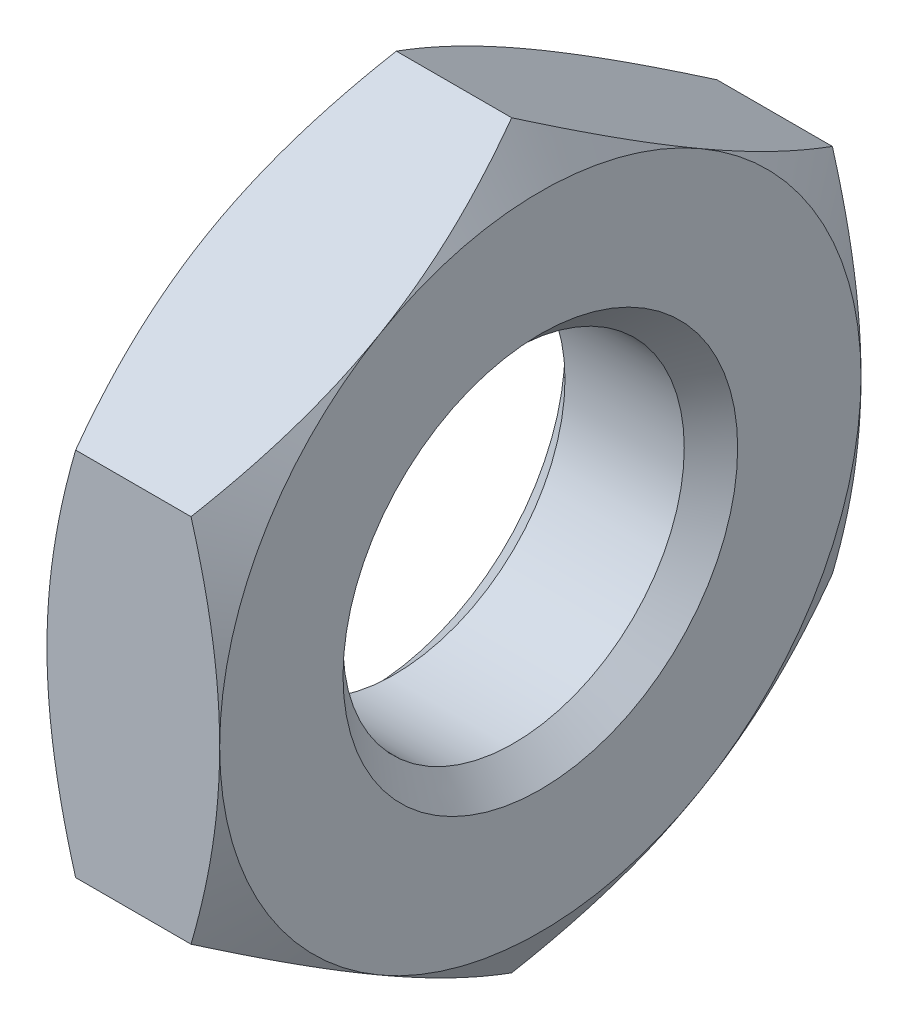
ISO-10303-21;
HEADER;
FILE_DESCRIPTION(('STEP AP214'),'2;1');
FILE_NAME('part.step','',(''),(''),'','','');
FILE_SCHEMA(('AUTOMOTIVE_DESIGN { 1 0 10303 214 1 1 1 1 }'));
ENDSEC;
DATA;
#1=APPLICATION_CONTEXT('core data for automotive mechanical design processes');
#2=APPLICATION_PROTOCOL_DEFINITION('international standard','automotive_design',2000,#1);
#3=PRODUCT_CONTEXT('',#1,'mechanical');
#4=PRODUCT('Part','Part','',(#3));
#5=PRODUCT_RELATED_PRODUCT_CATEGORY('part','',(#4));
#6=PRODUCT_DEFINITION_FORMATION('','',#4);
#7=PRODUCT_DEFINITION_CONTEXT('part definition',#1,'design');
#8=PRODUCT_DEFINITION('design','',#6,#7);
#9=PRODUCT_DEFINITION_SHAPE('','',#8);
#10=(LENGTH_UNIT() NAMED_UNIT(*) SI_UNIT(.MILLI.,.METRE.));
#11=(NAMED_UNIT(*) PLANE_ANGLE_UNIT() SI_UNIT($,.RADIAN.));
#12=(NAMED_UNIT(*) SI_UNIT($,.STERADIAN.) SOLID_ANGLE_UNIT());
#13=UNCERTAINTY_MEASURE_WITH_UNIT(LENGTH_MEASURE(1.E-05),#10,'distance_accuracy_value','');
#14=(GEOMETRIC_REPRESENTATION_CONTEXT(3) GLOBAL_UNCERTAINTY_ASSIGNED_CONTEXT((#13)) GLOBAL_UNIT_ASSIGNED_CONTEXT((#10,
#11,#12)) REPRESENTATION_CONTEXT('',''));
#15=CARTESIAN_POINT('',(0.,0.,0.));
#16=DIRECTION('',(0.,0.,1.));
#17=DIRECTION('',(1.,0.,0.));
#18=AXIS2_PLACEMENT_3D('',#15,#16,#17);
#19=CARTESIAN_POINT('',(27.5,0.,0.));
#20=DIRECTION('',(1.,0.,0.));
#21=DIRECTION('',(0.,0.,1.));
#22=AXIS2_PLACEMENT_3D('',#19,#20,#21);
#23=CONICAL_SURFACE('',#22,6.5,1.0471975511966);
#24=CARTESIAN_POINT('',(28.0805572502676,7.50555465416567,1.99999999888977E-06));
#25=CARTESIAN_POINT('',(28.0329411522362,7.42306527723567,-0.142873791927453));
#26=CARTESIAN_POINT('',(27.9874862264941,7.34026834106243,-0.286282292090547));
#27=CARTESIAN_POINT('',(27.9014939227888,7.17400208014972,-0.574263903575862));
#28=CARTESIAN_POINT('',(27.8609586661771,7.09053248178623,-0.718837488828798));
#29=CARTESIAN_POINT('',(27.7475281183766,6.83878732720467,-1.15487288712335));
#30=CARTESIAN_POINT('',(27.6830111190427,6.66951807893899,-1.44805582527849));
#31=CARTESIAN_POINT('',(27.6073591259132,6.41620974890769,-1.88679872287313));
#32=CARTESIAN_POINT('',(27.5858084178639,6.33292745266914,-2.0310478913293));
#33=CARTESIAN_POINT('',(27.5496718853767,6.16598660334749,-2.32019792421309));
#34=CARTESIAN_POINT('',(27.5350854455776,6.08232808416699,-2.46509872991969));
#35=CARTESIAN_POINT('',(27.5132491881389,5.91486579606871,-2.75515192125765));
#36=CARTESIAN_POINT('',(27.5059910453223,5.83106230055643,-2.90030383333679));
#37=CARTESIAN_POINT('',(27.4989592217746,5.66338258203352,-3.19073362521733));
#38=CARTESIAN_POINT('',(27.4991853097409,5.5795063613506,-3.33601150098701));
#39=CARTESIAN_POINT('',(27.5100914728005,5.34972711742178,-3.73400082599649));
#40=CARTESIAN_POINT('',(27.5283909317871,5.20389935455449,-3.98658192043674));
#41=CARTESIAN_POINT('',(27.5864124807486,4.91321237846649,-4.49006653211969));
#42=CARTESIAN_POINT('',(27.6261543917517,4.7683541871297,-4.74096827940755));
#43=CARTESIAN_POINT('',(27.7254952028274,4.47708246697613,-5.24546569752153));
#44=CARTESIAN_POINT('',(27.785514893733,4.33070568094781,-5.49899772797121));
#45=CARTESIAN_POINT('',(27.9217344418106,4.04013468328328,-6.00228145913216));
#46=CARTESIAN_POINT('',(27.9979023128666,3.89593675196615,-6.25203960251976));
#47=CARTESIAN_POINT('',(28.0805572502676,3.75277559503203,-6.500002));
#48=B_SPLINE_CURVE_WITH_KNOTS('',3,(#24,#25,#26,#27,#28,#29,#30,#31,#32,#33,#34,#35,#36,#37,#38,
#39,#40,#41,#42,#43,#44,#45,#46,#47),.UNSPECIFIED.,.F.,.F.,(4,2,2,2,2,2,2,2,2,2,2,4),(0.,
0.5150972308121,1.03041578730196,2.0631938175307,2.56693508465116,3.07063183306576,
3.5737557200387,4.07686405782424,4.95263248446346,5.82921184659663,6.72522956997887,
7.61948878328295),.UNSPECIFIED.);
#49=CARTESIAN_POINT('',(27.5,5.62916512459885,-3.25));
#50=VERTEX_POINT('',#49);
#51=CARTESIAN_POINT('',(28.0805565836007,3.75277674973256,-6.5));
#52=VERTEX_POINT('',#51);
#53=EDGE_CURVE('E233',#50,#52,#48,.T.);
#54=ORIENTED_EDGE('',*,*,#53,.T.);
#55=CARTESIAN_POINT('',(30.6104989341359,9.95307285908935,-6.5));
#56=CARTESIAN_POINT('',(30.4725830553751,9.66768488978743,-6.5));
#57=CARTESIAN_POINT('',(30.3360381273745,9.38162218475457,-6.5));
#58=CARTESIAN_POINT('',(30.0664735764141,8.8077824797937,-6.5));
#59=CARTESIAN_POINT('',(29.933454563785,8.52000519349761,-6.5));
#60=CARTESIAN_POINT('',(29.6710245296496,7.94081702987501,-6.5));
#61=CARTESIAN_POINT('',(29.5416385098717,7.64939478323306,-6.5));
#62=CARTESIAN_POINT('',(29.2884236931739,7.06415509657549,-6.5));
#63=CARTESIAN_POINT('',(29.1645946065949,6.77033778235014,-6.5));
#64=CARTESIAN_POINT('',(28.9225009036852,6.17619249466496,-6.5));
#65=CARTESIAN_POINT('',(28.8043232869134,5.875828877051,-6.5));
#66=CARTESIAN_POINT('',(28.5772233740448,5.27155865332413,-6.5));
#67=CARTESIAN_POINT('',(28.4683021076494,4.96765165730142,-6.5));
#68=CARTESIAN_POINT('',(28.2626411634057,4.35643639784011,-6.5));
#69=CARTESIAN_POINT('',(28.1658755889185,4.04913693634066,-6.5));
#70=CARTESIAN_POINT('',(27.9876696862604,3.43016616038199,-6.5));
#71=CARTESIAN_POINT('',(27.9062245118597,3.11849626203733,-6.5));
#72=CARTESIAN_POINT('',(27.762609080276,2.49058681273852,-6.5));
#73=CARTESIAN_POINT('',(27.700443946994,2.17434607035871,-6.5));
#74=CARTESIAN_POINT('',(27.5995896083704,1.53800734029216,-6.5));
#75=CARTESIAN_POINT('',(27.5609004236126,1.21790934922361,-6.5));
#76=CARTESIAN_POINT('',(27.5229537732643,0.737252871284541,-6.5));
#77=CARTESIAN_POINT('',(27.5136508237313,0.577446868410647,-6.5));
#78=CARTESIAN_POINT('',(27.5018165473539,0.257576967669784,-6.5));
#79=CARTESIAN_POINT('',(27.4992851325544,0.0975130731795708,-6.5));
#80=CARTESIAN_POINT('',(27.5010619211028,-0.222530422340151,-6.5));
#81=CARTESIAN_POINT('',(27.5053682047385,-0.382510034418977,-6.5));
#82=CARTESIAN_POINT('',(27.5207112496698,-0.702148832131741,-6.5));
#83=CARTESIAN_POINT('',(27.531748347135,-0.861808001361582,-6.5));
#84=CARTESIAN_POINT('',(27.5664256973321,-1.2487675251381,-6.5));
#85=CARTESIAN_POINT('',(27.5934383147711,-1.47577055977928,-6.5));
#86=CARTESIAN_POINT('',(27.6595713659633,-1.92803729286361,-6.5));
#87=CARTESIAN_POINT('',(27.6986951044107,-2.15330049935346,-6.5));
#88=CARTESIAN_POINT('',(27.7876628717206,-2.60190162254788,-6.5));
#89=CARTESIAN_POINT('',(27.8375170362986,-2.82523750985595,-6.5));
#90=CARTESIAN_POINT('',(27.9464245194654,-3.26961152922599,-6.5));
#91=CARTESIAN_POINT('',(28.0054769714683,-3.49064987565263,-6.5));
#92=CARTESIAN_POINT('',(28.1329119477722,-3.93587314871609,-6.5));
#93=CARTESIAN_POINT('',(28.2014876979859,-4.16000238632252,-6.5));
#94=CARTESIAN_POINT('',(28.3454152109145,-4.60589181343482,-6.5));
#95=CARTESIAN_POINT('',(28.4207623000669,-4.82765352051655,-6.5));
#96=CARTESIAN_POINT('',(28.5766760952858,-5.26791804038343,-6.5));
#97=CARTESIAN_POINT('',(28.6572110352833,-5.48643217049917,-6.5));
#98=CARTESIAN_POINT('',(28.8230080720055,-5.921765035856,-6.5));
#99=CARTESIAN_POINT('',(28.9082720791541,-6.13858304495038,-6.5));
#100=CARTESIAN_POINT('',(28.995432818,-6.35461336357443,-6.5));
#101=B_SPLINE_CURVE_WITH_KNOTS('',3,(#55,#56,#57,#58,#59,#60,#61,#62,#63,#64,#65,#66,#67,#68,
#69,#70,#71,#72,#73,#74,#75,#76,#77,#78,#79,#80,#81,#82,#83,#84,#85,#86,#87,#88,#89,#90,#91,#92,
#93,#94,#95,#96,#97,#98,#99,#100),.UNSPECIFIED.,.F.,.F.,(4,2,2,2,2,2,2,2,2,2,2,2,2,2,2,2,2,2,2,
2,2,2,4),(0.,0.950909051370078,1.90198164276349,2.85849656625615,3.81496157264779,
4.78317137315413,5.75148873932465,6.71770688363885,7.68361887285432,8.64978734516563,
9.61595666461726,10.0960644432439,10.5761659857554,11.0561327615996,11.5361235112802,
12.2215554610679,12.9071746059577,13.5934442356332,14.2796492497687,14.9826753898829,
15.6852199758561,16.3838102365337,17.0826847952346),.UNSPECIFIED.);
#102=CARTESIAN_POINT('',(27.5,0.,-6.5));
#103=VERTEX_POINT('',#102);
#104=EDGE_CURVE('E120',#52,#103,#101,.T.);
#105=ORIENTED_EDGE('',*,*,#104,.T.);
#106=CARTESIAN_POINT('',(27.5,0.,0.));
#107=DIRECTION('',(-1.,0.,0.));
#108=DIRECTION('',(0.,0.,-1.));
#109=AXIS2_PLACEMENT_3D('',#106,#107,#108);
#110=CIRCLE('',#109,6.5);
#111=EDGE_CURVE('E265',#50,#103,#110,.T.);
#112=ORIENTED_EDGE('',*,*,#111,.F.);
#113=EDGE_LOOP('',(#54,#105,#112));
#114=FACE_BOUND('',#113,.T.);
#115=ADVANCED_FACE('F16',(#114),#23,.T.);
#116=CARTESIAN_POINT('',(27.5,-5.62916512459885,-3.25));
#117=VERTEX_POINT('',#116);
#118=EDGE_CURVE('E257',#103,#117,#110,.T.);
#119=ORIENTED_EDGE('',*,*,#118,.F.);
#120=CARTESIAN_POINT('',(28.0805565836007,-3.75277674973257,-6.5));
#121=VERTEX_POINT('',#120);
#122=EDGE_CURVE('E226',#103,#121,#101,.T.);
#123=ORIENTED_EDGE('',*,*,#122,.T.);
#124=CARTESIAN_POINT('',(28.0805572502676,-3.75277559503203,-6.500002));
#125=CARTESIAN_POINT('',(28.0329411522362,-3.83526497196203,-6.35712620807255));
#126=CARTESIAN_POINT('',(27.9874862264941,-3.91806190813527,-6.21371770790945));
#127=CARTESIAN_POINT('',(27.9014939227888,-4.08432816904798,-5.92573609642414));
#128=CARTESIAN_POINT('',(27.8609586661771,-4.16779776741148,-5.7811625111712));
#129=CARTESIAN_POINT('',(27.7475281183766,-4.41954292199304,-5.34512711287665));
#130=CARTESIAN_POINT('',(27.6830111190428,-4.58881217025871,-5.05194417472152));
#131=CARTESIAN_POINT('',(27.6073591259132,-4.84212050029001,-4.61320127712688));
#132=CARTESIAN_POINT('',(27.5858084178639,-4.92540279652856,-4.4689521086707));
#133=CARTESIAN_POINT('',(27.5496718853767,-5.09234364585021,-4.17980207578692));
#134=CARTESIAN_POINT('',(27.5350854455776,-5.17600216503071,-4.03490127008031));
#135=CARTESIAN_POINT('',(27.5132491881389,-5.34346445312899,-3.74484807874235));
#136=CARTESIAN_POINT('',(27.5059910453223,-5.42726794864127,-3.59969616666321));
#137=CARTESIAN_POINT('',(27.4989592217746,-5.59494766716419,-3.30926637478267));
#138=CARTESIAN_POINT('',(27.499185309741,-5.67882388784711,-3.16398849901299));
#139=CARTESIAN_POINT('',(27.5100914728006,-5.90860313177593,-2.76599917400351));
#140=CARTESIAN_POINT('',(27.5283909317871,-6.05443089464322,-2.51341807956326));
#141=CARTESIAN_POINT('',(27.5864124807486,-6.34511787073121,-2.0099334678803));
#142=CARTESIAN_POINT('',(27.6261543917517,-6.489976062068,-1.75903172059244));
#143=CARTESIAN_POINT('',(27.7254952028274,-6.78124778222158,-1.25453430247847));
#144=CARTESIAN_POINT('',(27.785514893733,-6.92762456824989,-1.00100227202879));
#145=CARTESIAN_POINT('',(27.9217344418106,-7.21819556591443,-0.497718540867836));
#146=CARTESIAN_POINT('',(27.9979023128666,-7.36239349723155,-0.247960397480243));
#147=CARTESIAN_POINT('',(28.0805572502676,-7.50555465416567,2.00000000016023E-06));
#148=B_SPLINE_CURVE_WITH_KNOTS('',3,(#124,#125,#126,#127,#128,#129,#130,#131,#132,#133,#134,
#135,#136,#137,#138,#139,#140,#141,#142,#143,#144,#145,#146,#147),.UNSPECIFIED.,.F.,.F.,(4,2,2,
2,2,2,2,2,2,2,2,4),(0.,0.5150972308121,1.03041578730196,2.06319381753069,2.56693508465116,
3.07063183306576,3.5737557200387,4.07686405782424,4.95263248446347,5.82921184659663,
6.72522956997887,7.61948878328295),.UNSPECIFIED.);
#149=EDGE_CURVE('E219',#121,#117,#148,.T.);
#150=ORIENTED_EDGE('',*,*,#149,.T.);
#151=EDGE_LOOP('',(#119,#123,#150));
#152=FACE_BOUND('',#151,.T.);
#153=ADVANCED_FACE('F254',(#152),#23,.T.);
#154=CARTESIAN_POINT('',(27.5,-5.62916512459885,3.25));
#155=VERTEX_POINT('',#154);
#156=EDGE_CURVE('E263',#117,#155,#110,.T.);
#157=ORIENTED_EDGE('',*,*,#156,.F.);
#158=CARTESIAN_POINT('',(28.0805565836007,-7.50555349946514,0.));
#159=VERTEX_POINT('',#158);
#160=EDGE_CURVE('E210',#117,#159,#148,.T.);
#161=ORIENTED_EDGE('',*,*,#160,.T.);
#162=CARTESIAN_POINT('',(28.0805572502676,-7.50555465416567,-1.99999999954043E-06));
#163=CARTESIAN_POINT('',(28.0329411522362,-7.42306527723567,0.142873791927453));
#164=CARTESIAN_POINT('',(27.9874862264941,-7.34026834106243,0.286282292090546));
#165=CARTESIAN_POINT('',(27.9014939227888,-7.17400208014972,0.574263903575862));
#166=CARTESIAN_POINT('',(27.8609586661771,-7.09053248178623,0.718837488828797));
#167=CARTESIAN_POINT('',(27.7475281183766,-6.83878732720467,1.15487288712335));
#168=CARTESIAN_POINT('',(27.6830111190428,-6.66951807893899,1.44805582527848));
#169=CARTESIAN_POINT('',(27.6073591259132,-6.41620974890769,1.88679872287312));
#170=CARTESIAN_POINT('',(27.5858084178639,-6.33292745266914,2.0310478913293));
#171=CARTESIAN_POINT('',(27.5496718853767,-6.16598660334749,2.32019792421309));
#172=CARTESIAN_POINT('',(27.5350854455776,-6.08232808416699,2.46509872991969));
#173=CARTESIAN_POINT('',(27.5132491881389,-5.91486579606872,2.75515192125765));
#174=CARTESIAN_POINT('',(27.5059910453223,-5.83106230055643,2.90030383333679));
#175=CARTESIAN_POINT('',(27.4989592217746,-5.66338258203352,3.19073362521732));
#176=CARTESIAN_POINT('',(27.4991853097409,-5.5795063613506,3.336011500987));
#177=CARTESIAN_POINT('',(27.5100914728005,-5.34972711742178,3.73400082599649));
#178=CARTESIAN_POINT('',(27.5283909317871,-5.20389935455449,3.98658192043674));
#179=CARTESIAN_POINT('',(27.5864124807486,-4.9132123784665,4.49006653211969));
#180=CARTESIAN_POINT('',(27.6261543917517,-4.7683541871297,4.74096827940755));
#181=CARTESIAN_POINT('',(27.7254952028274,-4.47708246697613,5.24546569752153));
#182=CARTESIAN_POINT('',(27.785514893733,-4.33070568094781,5.49899772797121));
#183=CARTESIAN_POINT('',(27.9217344418106,-4.04013468328328,6.00228145913217));
#184=CARTESIAN_POINT('',(27.9979023128666,-3.89593675196615,6.25203960251976));
#185=CARTESIAN_POINT('',(28.0805572502676,-3.75277559503203,6.500002));
#186=B_SPLINE_CURVE_WITH_KNOTS('',3,(#162,#163,#164,#165,#166,#167,#168,#169,#170,#171,#172,
#173,#174,#175,#176,#177,#178,#179,#180,#181,#182,#183,#184,#185),.UNSPECIFIED.,.F.,.F.,(4,2,2,
2,2,2,2,2,2,2,2,4),(0.,0.515097230812099,1.03041578730196,2.0631938175307,2.56693508465116,
3.07063183306576,3.5737557200387,4.07686405782423,4.95263248446346,5.82921184659663,
6.72522956997887,7.61948878328295),.UNSPECIFIED.);
#187=EDGE_CURVE('E372',#159,#155,#186,.T.);
#188=ORIENTED_EDGE('',*,*,#187,.T.);
#189=EDGE_LOOP('',(#157,#161,#188));
#190=FACE_BOUND('',#189,.T.);
#191=ADVANCED_FACE('F341',(#190),#23,.T.);
#192=CARTESIAN_POINT('',(28.0805572502676,3.75277559503204,6.500002));
#193=CARTESIAN_POINT('',(28.0329411522362,3.83526497196203,6.35712620807255));
#194=CARTESIAN_POINT('',(27.9874862264941,3.91806190813527,6.21371770790945));
#195=CARTESIAN_POINT('',(27.9014939227888,4.08432816904798,5.92573609642414));
#196=CARTESIAN_POINT('',(27.8609586661771,4.16779776741147,5.7811625111712));
#197=CARTESIAN_POINT('',(27.7475281183766,4.41954292199304,5.34512711287665));
#198=CARTESIAN_POINT('',(27.6830111190428,4.58881217025871,5.05194417472152));
#199=CARTESIAN_POINT('',(27.6073591259132,4.84212050029001,4.61320127712688));
#200=CARTESIAN_POINT('',(27.5858084178639,4.92540279652856,4.4689521086707));
#201=CARTESIAN_POINT('',(27.5496718853767,5.09234364585021,4.17980207578691));
#202=CARTESIAN_POINT('',(27.5350854455776,5.17600216503071,4.03490127008031));
#203=CARTESIAN_POINT('',(27.5132491881389,5.34346445312899,3.74484807874235));
#204=CARTESIAN_POINT('',(27.5059910453223,5.42726794864127,3.59969616666321));
#205=CARTESIAN_POINT('',(27.4989592217746,5.59494766716419,3.30926637478267));
#206=CARTESIAN_POINT('',(27.499185309741,5.67882388784711,3.16398849901299));
#207=CARTESIAN_POINT('',(27.5100914728006,5.90860313177593,2.76599917400351));
#208=CARTESIAN_POINT('',(27.5283909317871,6.05443089464322,2.51341807956326));
#209=CARTESIAN_POINT('',(27.5864124807485,6.34511787073121,2.0099334678803));
#210=CARTESIAN_POINT('',(27.6261543917517,6.489976062068,1.75903172059244));
#211=CARTESIAN_POINT('',(27.7254952028274,6.78124778222158,1.25453430247847));
#212=CARTESIAN_POINT('',(27.785514893733,6.92762456824989,1.00100227202879));
#213=CARTESIAN_POINT('',(27.9217344418106,7.21819556591443,0.497718540867835));
#214=CARTESIAN_POINT('',(27.9979023128666,7.36239349723155,0.247960397480241));
#215=CARTESIAN_POINT('',(28.0805572502676,7.50555465416567,-2.00000000021285E-06));
#216=B_SPLINE_CURVE_WITH_KNOTS('',3,(#192,#193,#194,#195,#196,#197,#198,#199,#200,#201,#202,
#203,#204,#205,#206,#207,#208,#209,#210,#211,#212,#213,#214,#215),.UNSPECIFIED.,.F.,.F.,(4,2,2,
2,2,2,2,2,2,2,2,4),(0.,0.515097230812099,1.03041578730196,2.06319381753069,2.56693508465116,
3.07063183306576,3.5737557200387,4.07686405782424,4.95263248446346,5.82921184659663,
6.72522956997887,7.61948878328294),.UNSPECIFIED.);
#217=CARTESIAN_POINT('',(27.5,5.62916512459885,3.25));
#218=VERTEX_POINT('',#217);
#219=CARTESIAN_POINT('',(28.0805565836007,7.50555349946514,0.));
#220=VERTEX_POINT('',#219);
#221=EDGE_CURVE('E366',#218,#220,#216,.T.);
#222=ORIENTED_EDGE('',*,*,#221,.T.);
#223=EDGE_CURVE('E220',#220,#50,#48,.T.);
#224=ORIENTED_EDGE('',*,*,#223,.T.);
#225=EDGE_CURVE('E273',#218,#50,#110,.T.);
#226=ORIENTED_EDGE('',*,*,#225,.F.);
#227=EDGE_LOOP('',(#222,#224,#226));
#228=FACE_BOUND('',#227,.T.);
#229=ADVANCED_FACE('F349',(#228),#23,.T.);
#230=CARTESIAN_POINT('',(27.5,0.,6.5));
#231=VERTEX_POINT('',#230);
#232=EDGE_CURVE('E271',#155,#231,#110,.T.);
#233=ORIENTED_EDGE('',*,*,#232,.F.);
#234=CARTESIAN_POINT('',(28.0805565836007,-3.75277674973256,6.5));
#235=VERTEX_POINT('',#234);
#236=EDGE_CURVE('E39',#155,#235,#186,.T.);
#237=ORIENTED_EDGE('',*,*,#236,.T.);
#238=CARTESIAN_POINT('',(30.6104989341359,9.95307285908936,6.5));
#239=CARTESIAN_POINT('',(30.4725830553751,9.66768488978744,6.5));
#240=CARTESIAN_POINT('',(30.3360381273745,9.38162218475457,6.5));
#241=CARTESIAN_POINT('',(30.0664735764141,8.80778247979371,6.5));
#242=CARTESIAN_POINT('',(29.933454563785,8.52000519349762,6.5));
#243=CARTESIAN_POINT('',(29.6710245296496,7.94081702987502,6.5));
#244=CARTESIAN_POINT('',(29.5416385098717,7.64939478323307,6.5));
#245=CARTESIAN_POINT('',(29.2884236931739,7.0641550965755,6.5));
#246=CARTESIAN_POINT('',(29.1645946065949,6.77033778235015,6.5));
#247=CARTESIAN_POINT('',(28.9225009036852,6.17619249466498,6.5));
#248=CARTESIAN_POINT('',(28.8043232869134,5.87582887705101,6.5));
#249=CARTESIAN_POINT('',(28.5772233740448,5.27155865332414,6.5));
#250=CARTESIAN_POINT('',(28.4683021076494,4.96765165730143,6.5));
#251=CARTESIAN_POINT('',(28.2626411634057,4.35643639784012,6.5));
#252=CARTESIAN_POINT('',(28.1658755889185,4.04913693634067,6.5));
#253=CARTESIAN_POINT('',(27.9876696862604,3.430166160382,6.5));
#254=CARTESIAN_POINT('',(27.9062245118597,3.11849626203734,6.5));
#255=CARTESIAN_POINT('',(27.762609080276,2.49058681273853,6.5));
#256=CARTESIAN_POINT('',(27.700443946994,2.17434607035872,6.5));
#257=CARTESIAN_POINT('',(27.5995896083704,1.53800734029217,6.5));
#258=CARTESIAN_POINT('',(27.5609004236126,1.21790934922361,6.5));
#259=CARTESIAN_POINT('',(27.5229537732643,0.737252871284546,6.5));
#260=CARTESIAN_POINT('',(27.5136508237313,0.577446868410651,6.5));
#261=CARTESIAN_POINT('',(27.5018165473539,0.257576967669787,6.5));
#262=CARTESIAN_POINT('',(27.4992851325544,0.0975130731795743,6.5));
#263=CARTESIAN_POINT('',(27.5010619211028,-0.222530422340148,6.5));
#264=CARTESIAN_POINT('',(27.5053682047385,-0.382510034418974,6.5));
#265=CARTESIAN_POINT('',(27.5207112496698,-0.702148832131738,6.5));
#266=CARTESIAN_POINT('',(27.531748347135,-0.861808001361578,6.5));
#267=CARTESIAN_POINT('',(27.5664256973321,-1.2487675251381,6.5));
#268=CARTESIAN_POINT('',(27.5934383147711,-1.47577055977927,6.5));
#269=CARTESIAN_POINT('',(27.6595713659633,-1.9280372928636,6.5));
#270=CARTESIAN_POINT('',(27.6986951044107,-2.15330049935345,6.5));
#271=CARTESIAN_POINT('',(27.7876628717206,-2.60190162254788,6.5));
#272=CARTESIAN_POINT('',(27.8375170362986,-2.82523750985594,6.5));
#273=CARTESIAN_POINT('',(27.9464245194654,-3.26961152922599,6.5));
#274=CARTESIAN_POINT('',(28.0054769714683,-3.49064987565262,6.5));
#275=CARTESIAN_POINT('',(28.1329119477722,-3.93587314871608,6.5));
#276=CARTESIAN_POINT('',(28.2014876979859,-4.16000238632251,6.50000000000001));
#277=CARTESIAN_POINT('',(28.3454152109145,-4.60589181343481,6.50000000000001));
#278=CARTESIAN_POINT('',(28.4207623000669,-4.82765352051654,6.50000000000001));
#279=CARTESIAN_POINT('',(28.5766760952858,-5.26791804038343,6.50000000000001));
#280=CARTESIAN_POINT('',(28.6572110352833,-5.48643217049916,6.50000000000001));
#281=CARTESIAN_POINT('',(28.8230080720055,-5.921765035856,6.5));
#282=CARTESIAN_POINT('',(28.9082720791541,-6.13858304495038,6.5));
#283=CARTESIAN_POINT('',(28.995432818,-6.35461336357443,6.5));
#284=B_SPLINE_CURVE_WITH_KNOTS('',3,(#238,#239,#240,#241,#242,#243,#244,#245,#246,#247,#248,
#249,#250,#251,#252,#253,#254,#255,#256,#257,#258,#259,#260,#261,#262,#263,#264,#265,#266,#267,
#268,#269,#270,#271,#272,#273,#274,#275,#276,#277,#278,#279,#280,#281,#282,#283),.UNSPECIFIED.,
.F.,.F.,(4,2,2,2,2,2,2,2,2,2,2,2,2,2,2,2,2,2,2,2,2,2,4),(0.,0.950909051370075,1.90198164276349,
2.85849656625615,3.81496157264779,4.78317137315413,5.75148873932465,6.71770688363886,
7.68361887285431,8.64978734516563,9.61595666461726,10.0960644432439,10.5761659857554,
11.0561327615996,11.5361235112802,12.2215554610679,12.9071746059577,13.5934442356332,
14.2796492497687,14.982675389883,15.6852199758561,16.3838102365337,17.0826847952346),.UNSPECIFIED.);
#285=EDGE_CURVE('E11',#235,#231,#284,.F.);
#286=ORIENTED_EDGE('',*,*,#285,.T.);
#287=EDGE_LOOP('',(#233,#237,#286));
#288=FACE_BOUND('',#287,.T.);
#289=ADVANCED_FACE('F344',(#288),#23,.T.);
#290=CARTESIAN_POINT('',(28.0805565836007,3.75277674973257,6.5));
#291=VERTEX_POINT('',#290);
#292=EDGE_CURVE('E21',#231,#291,#284,.F.);
#293=ORIENTED_EDGE('',*,*,#292,.T.);
#294=EDGE_CURVE('E127',#291,#218,#216,.T.);
#295=ORIENTED_EDGE('',*,*,#294,.T.);
#296=EDGE_CURVE('E280',#231,#218,#110,.T.);
#297=ORIENTED_EDGE('',*,*,#296,.F.);
#298=EDGE_LOOP('',(#293,#295,#297));
#299=FACE_BOUND('',#298,.T.);
#300=ADVANCED_FACE('F155',(#299),#23,.T.);
#301=CARTESIAN_POINT('',(30.4183196037914,0.,0.));
#302=DIRECTION('',(-1.,0.,0.));
#303=DIRECTION('',(0.,0.,-1.));
#304=AXIS2_PLACEMENT_3D('',#301,#302,#303);
#305=CONICAL_SURFACE('',#304,7.5075,1.0471975511966);
#306=CARTESIAN_POINT('',(27.8895010658641,9.95307285908936,6.5));
#307=CARTESIAN_POINT('',(28.0274169446249,9.66768488978744,6.5));
#308=CARTESIAN_POINT('',(28.1639618726255,9.38162218475457,6.5));
#309=CARTESIAN_POINT('',(28.4335264235859,8.80778247979371,6.5));
#310=CARTESIAN_POINT('',(28.566545436215,8.52000519349762,6.5));
#311=CARTESIAN_POINT('',(28.8289754703504,7.94081702987502,6.5));
#312=CARTESIAN_POINT('',(28.9583614901283,7.64939478323306,6.5));
#313=CARTESIAN_POINT('',(29.2115763068261,7.0641550965755,6.5));
#314=CARTESIAN_POINT('',(29.3354053934051,6.77033778235014,6.5));
#315=CARTESIAN_POINT('',(29.5774990963148,6.17619249466496,6.5));
#316=CARTESIAN_POINT('',(29.6956767130866,5.875828877051,6.5));
#317=CARTESIAN_POINT('',(29.9227766259552,5.27155865332412,6.5));
#318=CARTESIAN_POINT('',(30.0316978923506,4.96765165730142,6.5));
#319=CARTESIAN_POINT('',(30.2373588365943,4.3564363978401,6.5));
#320=CARTESIAN_POINT('',(30.3341244110815,4.04913693634065,6.5));
#321=CARTESIAN_POINT('',(30.5123303137396,3.43016616038198,6.5));
#322=CARTESIAN_POINT('',(30.5937754881404,3.11849626203734,6.5));
#323=CARTESIAN_POINT('',(30.737390919724,2.49058681273853,6.5));
#324=CARTESIAN_POINT('',(30.799556053006,2.17434607035872,6.5));
#325=CARTESIAN_POINT('',(30.9004103916296,1.53800734029216,6.5));
#326=CARTESIAN_POINT('',(30.9390995763874,1.21790934922361,6.5));
#327=CARTESIAN_POINT('',(30.9770462267357,0.737252871284541,6.5));
#328=CARTESIAN_POINT('',(30.9863491762687,0.577446868410647,6.5));
#329=CARTESIAN_POINT('',(30.9981834526461,0.257576967669783,6.5));
#330=CARTESIAN_POINT('',(31.0007148674456,0.09751307317957,6.5));
#331=CARTESIAN_POINT('',(30.9989380788972,-0.22253042234015,6.5));
#332=CARTESIAN_POINT('',(30.9946317952615,-0.382510034418974,6.5));
#333=CARTESIAN_POINT('',(30.9792887503302,-0.702148832131738,6.5));
#334=CARTESIAN_POINT('',(30.968251652865,-0.861808001361579,6.5));
#335=CARTESIAN_POINT('',(30.9335743026679,-1.2487675251381,6.5));
#336=CARTESIAN_POINT('',(30.9065616852289,-1.47577055977927,6.5));
#337=CARTESIAN_POINT('',(30.8404286340366,-1.92803729286359,6.5));
#338=CARTESIAN_POINT('',(30.8013048955893,-2.15330049935344,6.5));
#339=CARTESIAN_POINT('',(30.7123371282794,-2.60190162254787,6.5));
#340=CARTESIAN_POINT('',(30.6624829637014,-2.82523750985593,6.5));
#341=CARTESIAN_POINT('',(30.5535754805346,-3.26961152922598,6.5));
#342=CARTESIAN_POINT('',(30.4945230285317,-3.49064987565262,6.5));
#343=CARTESIAN_POINT('',(30.3670880522278,-3.93587314871608,6.5));
#344=CARTESIAN_POINT('',(30.2985123020141,-4.16000238632251,6.50000000000001));
#345=CARTESIAN_POINT('',(30.1545847890855,-4.60589181343481,6.50000000000001));
#346=CARTESIAN_POINT('',(30.0792376999331,-4.82765352051654,6.50000000000001));
#347=CARTESIAN_POINT('',(29.9233239047142,-5.26791804038343,6.50000000000001));
#348=CARTESIAN_POINT('',(29.8427889647167,-5.48643217049917,6.50000000000001));
#349=CARTESIAN_POINT('',(29.6769919279945,-5.92176503585599,6.5));
#350=CARTESIAN_POINT('',(29.5917279208459,-6.13858304495038,6.5));
#351=CARTESIAN_POINT('',(29.504567182,-6.35461336357443,6.5));
#352=B_SPLINE_CURVE_WITH_KNOTS('',3,(#306,#307,#308,#309,#310,#311,#312,#313,#314,#315,#316,
#317,#318,#319,#320,#321,#322,#323,#324,#325,#326,#327,#328,#329,#330,#331,#332,#333,#334,#335,
#336,#337,#338,#339,#340,#341,#342,#343,#344,#345,#346,#347,#348,#349,#350,#351),.UNSPECIFIED.,
.F.,.F.,(4,2,2,2,2,2,2,2,2,2,2,2,2,2,2,2,2,2,2,2,2,2,4),(0.,0.950909051370073,1.90198164276349,
2.85849656625615,3.8149615726478,4.78317137315415,5.75148873932467,6.71770688363887,
7.68361887285433,8.64978734516564,9.61595666461727,10.0960644432439,10.5761659857554,
11.0561327615996,11.5361235112802,12.2215554610679,12.9071746059577,13.5934442356332,
14.2796492497687,14.982675389883,15.6852199758561,16.3838102365337,17.0826847952346),.UNSPECIFIED.);
#353=CARTESIAN_POINT('',(31.,0.,6.5));
#354=VERTEX_POINT('',#353);
#355=CARTESIAN_POINT('',(30.4194434163993,-3.75277674973256,6.5));
#356=VERTEX_POINT('',#355);
#357=EDGE_CURVE('E116',#354,#356,#352,.T.);
#358=ORIENTED_EDGE('',*,*,#357,.T.);
#359=CARTESIAN_POINT('',(30.4194427497324,-3.75277559503203,6.500002));
#360=CARTESIAN_POINT('',(30.4670588477638,-3.83526497196202,6.35712620807255));
#361=CARTESIAN_POINT('',(30.5125137735059,-3.91806190813526,6.21371770790945));
#362=CARTESIAN_POINT('',(30.5985060772112,-4.08432816904797,5.92573609642414));
#363=CARTESIAN_POINT('',(30.6390413338229,-4.16779776741147,5.7811625111712));
#364=CARTESIAN_POINT('',(30.7524718816234,-4.41954292199303,5.34512711287665));
#365=CARTESIAN_POINT('',(30.8169888809573,-4.5888121702587,5.05194417472151));
#366=CARTESIAN_POINT('',(30.8926408740868,-4.84212050029001,4.61320127712687));
#367=CARTESIAN_POINT('',(30.9141915821361,-4.92540279652856,4.4689521086707));
#368=CARTESIAN_POINT('',(30.9503281146233,-5.0923436458502,4.17980207578691));
#369=CARTESIAN_POINT('',(30.9649145544224,-5.1760021650307,4.03490127008031));
#370=CARTESIAN_POINT('',(30.9867508118611,-5.34346445312898,3.74484807874235));
#371=CARTESIAN_POINT('',(30.9940089546777,-5.42726794864126,3.59969616666321));
#372=CARTESIAN_POINT('',(31.0010407782254,-5.59494766716418,3.30926637478268));
#373=CARTESIAN_POINT('',(31.0008146902591,-5.6788238878471,3.163988499013));
#374=CARTESIAN_POINT('',(30.9899085271995,-5.90860313177592,2.76599917400351));
#375=CARTESIAN_POINT('',(30.9716090682129,-6.05443089464321,2.51341807956326));
#376=CARTESIAN_POINT('',(30.9135875192514,-6.3451178707312,2.0099334678803));
#377=CARTESIAN_POINT('',(30.8738456082483,-6.48997606206799,1.75903172059244));
#378=CARTESIAN_POINT('',(30.7745047971726,-6.78124778222157,1.25453430247847));
#379=CARTESIAN_POINT('',(30.714485106267,-6.92762456824988,1.00100227202879));
#380=CARTESIAN_POINT('',(30.5782655581894,-7.21819556591442,0.497718540867833));
#381=CARTESIAN_POINT('',(30.5020976871334,-7.36239349723155,0.247960397480241));
#382=CARTESIAN_POINT('',(30.4194427497324,-7.50555465416567,-1.99999999926572E-06));
#383=B_SPLINE_CURVE_WITH_KNOTS('',3,(#359,#360,#361,#362,#363,#364,#365,#366,#367,#368,#369,
#370,#371,#372,#373,#374,#375,#376,#377,#378,#379,#380,#381,#382),.UNSPECIFIED.,.F.,.F.,(4,2,2,
2,2,2,2,2,2,2,2,4),(0.,0.515097230812099,1.03041578730196,2.0631938175307,2.56693508465117,
3.07063183306577,3.5737557200387,4.07686405782424,4.95263248446346,5.82921184659663,
6.72522956997888,7.61948878328295),.UNSPECIFIED.);
#384=CARTESIAN_POINT('',(31.,-5.62916512459885,3.25));
#385=VERTEX_POINT('',#384);
#386=EDGE_CURVE('E122',#356,#385,#383,.T.);
#387=ORIENTED_EDGE('',*,*,#386,.T.);
#388=CARTESIAN_POINT('',(31.,0.,0.));
#389=DIRECTION('',(-1.,0.,0.));
#390=DIRECTION('',(0.,0.,-1.));
#391=AXIS2_PLACEMENT_3D('',#388,#389,#390);
#392=CIRCLE('',#391,6.5);
#393=EDGE_CURVE('E130',#385,#354,#392,.T.);
#394=ORIENTED_EDGE('',*,*,#393,.T.);
#395=EDGE_LOOP('',(#358,#387,#394));
#396=FACE_BOUND('',#395,.T.);
#397=ADVANCED_FACE('F129',(#396),#305,.T.);
#398=CARTESIAN_POINT('',(31.,-5.62916512459885,-3.25));
#399=VERTEX_POINT('',#398);
#400=EDGE_CURVE('E283',#399,#385,#392,.T.);
#401=ORIENTED_EDGE('',*,*,#400,.T.);
#402=CARTESIAN_POINT('',(30.4194434163993,-7.50555349946514,0.));
#403=VERTEX_POINT('',#402);
#404=EDGE_CURVE('E46',#385,#403,#383,.T.);
#405=ORIENTED_EDGE('',*,*,#404,.T.);
#406=CARTESIAN_POINT('',(30.4194427497324,-7.50555465416567,2.00000000051254E-06));
#407=CARTESIAN_POINT('',(30.4670588477638,-7.42306527723568,-0.142873791927454));
#408=CARTESIAN_POINT('',(30.5125137735059,-7.34026834106244,-0.286282292090549));
#409=CARTESIAN_POINT('',(30.5985060772112,-7.17400208014973,-0.574263903575866));
#410=CARTESIAN_POINT('',(30.6390413338229,-7.09053248178624,-0.718837488828801));
#411=CARTESIAN_POINT('',(30.7524718816234,-6.83878732720467,-1.15487288712335));
#412=CARTESIAN_POINT('',(30.8169888809572,-6.669518078939,-1.44805582527849));
#413=CARTESIAN_POINT('',(30.8926408740868,-6.4162097489077,-1.88679872287313));
#414=CARTESIAN_POINT('',(30.9141915821361,-6.33292745266914,-2.03104789132931));
#415=CARTESIAN_POINT('',(30.9503281146233,-6.1659866033475,-2.32019792421309));
#416=CARTESIAN_POINT('',(30.9649145544224,-6.082328084167,-2.46509872991969));
#417=CARTESIAN_POINT('',(30.9867508118611,-5.91486579606872,-2.75515192125765));
#418=CARTESIAN_POINT('',(30.9940089546777,-5.83106230055644,-2.9003038333368));
#419=CARTESIAN_POINT('',(31.0010407782254,-5.66338258203352,-3.19073362521733));
#420=CARTESIAN_POINT('',(31.0008146902591,-5.5795063613506,-3.33601150098701));
#421=CARTESIAN_POINT('',(30.9899085271995,-5.34972711742178,-3.73400082599649));
#422=CARTESIAN_POINT('',(30.9716090682129,-5.20389935455449,-3.98658192043674));
#423=CARTESIAN_POINT('',(30.9135875192514,-4.9132123784665,-4.4900665321197));
#424=CARTESIAN_POINT('',(30.8738456082483,-4.76835418712971,-4.74096827940756));
#425=CARTESIAN_POINT('',(30.7745047971726,-4.47708246697614,-5.24546569752153));
#426=CARTESIAN_POINT('',(30.714485106267,-4.33070568094782,-5.49899772797121));
#427=CARTESIAN_POINT('',(30.5782655581894,-4.04013468328328,-6.00228145913217));
#428=CARTESIAN_POINT('',(30.5020976871334,-3.89593675196615,-6.25203960251976));
#429=CARTESIAN_POINT('',(30.4194427497324,-3.75277559503203,-6.500002));
#430=B_SPLINE_CURVE_WITH_KNOTS('',3,(#406,#407,#408,#409,#410,#411,#412,#413,#414,#415,#416,
#417,#418,#419,#420,#421,#422,#423,#424,#425,#426,#427,#428,#429),.UNSPECIFIED.,.F.,.F.,(4,2,2,
2,2,2,2,2,2,2,2,4),(0.,0.515097230812099,1.03041578730196,2.0631938175307,2.56693508465116,
3.07063183306576,3.5737557200387,4.07686405782424,4.95263248446346,5.82921184659663,
6.72522956997887,7.61948878328295),.UNSPECIFIED.);
#431=EDGE_CURVE('E195',#403,#399,#430,.T.);
#432=ORIENTED_EDGE('',*,*,#431,.T.);
#433=EDGE_LOOP('',(#401,#405,#432));
#434=FACE_BOUND('',#433,.T.);
#435=ADVANCED_FACE('F154',(#434),#305,.T.);
#436=CARTESIAN_POINT('',(31.,0.,-6.5));
#437=VERTEX_POINT('',#436);
#438=EDGE_CURVE('E274',#437,#399,#392,.T.);
#439=ORIENTED_EDGE('',*,*,#438,.T.);
#440=CARTESIAN_POINT('',(30.4194434163993,-3.75277674973257,-6.5));
#441=VERTEX_POINT('',#440);
#442=EDGE_CURVE('E188',#399,#441,#430,.T.);
#443=ORIENTED_EDGE('',*,*,#442,.T.);
#444=CARTESIAN_POINT('',(27.8895010658641,9.95307285908935,-6.5));
#445=CARTESIAN_POINT('',(28.0274169446249,9.66768488978743,-6.5));
#446=CARTESIAN_POINT('',(28.1639618726255,9.38162218475457,-6.5));
#447=CARTESIAN_POINT('',(28.4335264235859,8.8077824797937,-6.5));
#448=CARTESIAN_POINT('',(28.566545436215,8.52000519349761,-6.5));
#449=CARTESIAN_POINT('',(28.8289754703504,7.94081702987501,-6.5));
#450=CARTESIAN_POINT('',(28.9583614901283,7.64939478323305,-6.5));
#451=CARTESIAN_POINT('',(29.2115763068261,7.06415509657548,-6.5));
#452=CARTESIAN_POINT('',(29.3354053934051,6.77033778235013,-6.5));
#453=CARTESIAN_POINT('',(29.5774990963148,6.17619249466496,-6.5));
#454=CARTESIAN_POINT('',(29.6956767130866,5.87582887705099,-6.5));
#455=CARTESIAN_POINT('',(29.9227766259552,5.27155865332412,-6.5));
#456=CARTESIAN_POINT('',(30.0316978923506,4.96765165730141,-6.5));
#457=CARTESIAN_POINT('',(30.2373588365943,4.35643639784009,-6.5));
#458=CARTESIAN_POINT('',(30.3341244110815,4.04913693634065,-6.5));
#459=CARTESIAN_POINT('',(30.5123303137396,3.43016616038198,-6.5));
#460=CARTESIAN_POINT('',(30.5937754881404,3.11849626203734,-6.5));
#461=CARTESIAN_POINT('',(30.737390919724,2.49058681273853,-6.5));
#462=CARTESIAN_POINT('',(30.799556053006,2.17434607035872,-6.5));
#463=CARTESIAN_POINT('',(30.9004103916296,1.53800734029216,-6.5));
#464=CARTESIAN_POINT('',(30.9390995763874,1.21790934922361,-6.5));
#465=CARTESIAN_POINT('',(30.9770462267357,0.73725287128454,-6.5));
#466=CARTESIAN_POINT('',(30.9863491762687,0.577446868410646,-6.5));
#467=CARTESIAN_POINT('',(30.9981834526461,0.257576967669781,-6.5));
#468=CARTESIAN_POINT('',(31.0007148674456,0.097513073179568,-6.5));
#469=CARTESIAN_POINT('',(30.9989380788972,-0.222530422340153,-6.5));
#470=CARTESIAN_POINT('',(30.9946317952615,-0.382510034418978,-6.5));
#471=CARTESIAN_POINT('',(30.9792887503302,-0.702148832131741,-6.5));
#472=CARTESIAN_POINT('',(30.968251652865,-0.861808001361583,-6.5));
#473=CARTESIAN_POINT('',(30.9335743026679,-1.2487675251381,-6.5));
#474=CARTESIAN_POINT('',(30.9065616852289,-1.47577055977927,-6.5));
#475=CARTESIAN_POINT('',(30.8404286340367,-1.92803729286359,-6.5));
#476=CARTESIAN_POINT('',(30.8013048955893,-2.15330049935345,-6.5));
#477=CARTESIAN_POINT('',(30.7123371282794,-2.60190162254787,-6.5));
#478=CARTESIAN_POINT('',(30.6624829637014,-2.82523750985594,-6.5));
#479=CARTESIAN_POINT('',(30.5535754805346,-3.26961152922599,-6.5));
#480=CARTESIAN_POINT('',(30.4945230285317,-3.49064987565262,-6.5));
#481=CARTESIAN_POINT('',(30.3670880522278,-3.93587314871608,-6.5));
#482=CARTESIAN_POINT('',(30.2985123020141,-4.16000238632252,-6.5));
#483=CARTESIAN_POINT('',(30.1545847890855,-4.60589181343482,-6.5));
#484=CARTESIAN_POINT('',(30.0792376999331,-4.82765352051655,-6.5));
#485=CARTESIAN_POINT('',(29.9233239047142,-5.26791804038344,-6.5));
#486=CARTESIAN_POINT('',(29.8427889647167,-5.48643217049917,-6.5));
#487=CARTESIAN_POINT('',(29.6769919279945,-5.921765035856,-6.5));
#488=CARTESIAN_POINT('',(29.5917279208459,-6.13858304495038,-6.5));
#489=CARTESIAN_POINT('',(29.504567182,-6.35461336357443,-6.5));
#490=B_SPLINE_CURVE_WITH_KNOTS('',3,(#444,#445,#446,#447,#448,#449,#450,#451,#452,#453,#454,
#455,#456,#457,#458,#459,#460,#461,#462,#463,#464,#465,#466,#467,#468,#469,#470,#471,#472,#473,
#474,#475,#476,#477,#478,#479,#480,#481,#482,#483,#484,#485,#486,#487,#488,#489),.UNSPECIFIED.,
.F.,.F.,(4,2,2,2,2,2,2,2,2,2,2,2,2,2,2,2,2,2,2,2,2,2,4),(0.,0.950909051370075,1.90198164276349,
2.85849656625615,3.8149615726478,4.78317137315414,5.75148873932466,6.71770688363887,
7.68361887285432,8.64978734516563,9.61595666461726,10.0960644432439,10.5761659857554,
11.0561327615996,11.5361235112802,12.2215554610679,12.9071746059577,13.5934442356332,
14.2796492497687,14.982675389883,15.6852199758561,16.3838102365337,17.0826847952346),.UNSPECIFIED.);
#491=EDGE_CURVE('E196',#441,#437,#490,.F.);
#492=ORIENTED_EDGE('',*,*,#491,.T.);
#493=EDGE_LOOP('',(#439,#443,#492));
#494=FACE_BOUND('',#493,.T.);
#495=ADVANCED_FACE('F452',(#494),#305,.T.);
#496=CARTESIAN_POINT('',(31.,5.62916512459885,-3.25));
#497=VERTEX_POINT('',#496);
#498=EDGE_CURVE('E284',#497,#437,#392,.T.);
#499=ORIENTED_EDGE('',*,*,#498,.T.);
#500=CARTESIAN_POINT('',(30.4194434163993,3.75277674973256,-6.5));
#501=VERTEX_POINT('',#500);
#502=EDGE_CURVE('E181',#437,#501,#490,.F.);
#503=ORIENTED_EDGE('',*,*,#502,.T.);
#504=CARTESIAN_POINT('',(30.4194427497324,3.75277559503203,-6.500002));
#505=CARTESIAN_POINT('',(30.4670588477638,3.83526497196202,-6.35712620807255));
#506=CARTESIAN_POINT('',(30.5125137735059,3.91806190813527,-6.21371770790945));
#507=CARTESIAN_POINT('',(30.5985060772112,4.08432816904797,-5.92573609642414));
#508=CARTESIAN_POINT('',(30.6390413338229,4.16779776741147,-5.7811625111712));
#509=CARTESIAN_POINT('',(30.7524718816234,4.41954292199303,-5.34512711287665));
#510=CARTESIAN_POINT('',(30.8169888809573,4.5888121702587,-5.05194417472151));
#511=CARTESIAN_POINT('',(30.8926408740868,4.84212050029001,-4.61320127712687));
#512=CARTESIAN_POINT('',(30.9141915821361,4.92540279652856,-4.4689521086707));
#513=CARTESIAN_POINT('',(30.9503281146233,5.0923436458502,-4.17980207578691));
#514=CARTESIAN_POINT('',(30.9649145544224,5.1760021650307,-4.03490127008031));
#515=CARTESIAN_POINT('',(30.9867508118611,5.34346445312898,-3.74484807874235));
#516=CARTESIAN_POINT('',(30.9940089546777,5.42726794864126,-3.59969616666321));
#517=CARTESIAN_POINT('',(31.0010407782254,5.59494766716418,-3.30926637478267));
#518=CARTESIAN_POINT('',(31.0008146902591,5.6788238878471,-3.16398849901299));
#519=CARTESIAN_POINT('',(30.9899085271995,5.90860313177592,-2.76599917400351));
#520=CARTESIAN_POINT('',(30.9716090682129,6.05443089464321,-2.51341807956326));
#521=CARTESIAN_POINT('',(30.9135875192514,6.3451178707312,-2.0099334678803));
#522=CARTESIAN_POINT('',(30.8738456082483,6.48997606206799,-1.75903172059245));
#523=CARTESIAN_POINT('',(30.7745047971726,6.78124778222157,-1.25453430247847));
#524=CARTESIAN_POINT('',(30.714485106267,6.92762456824988,-1.00100227202879));
#525=CARTESIAN_POINT('',(30.5782655581894,7.21819556591442,-0.497718540867834));
#526=CARTESIAN_POINT('',(30.5020976871334,7.36239349723155,-0.247960397480241));
#527=CARTESIAN_POINT('',(30.4194427497324,7.50555465416567,1.9999999985867E-06));
#528=B_SPLINE_CURVE_WITH_KNOTS('',3,(#504,#505,#506,#507,#508,#509,#510,#511,#512,#513,#514,
#515,#516,#517,#518,#519,#520,#521,#522,#523,#524,#525,#526,#527),.UNSPECIFIED.,.F.,.F.,(4,2,2,
2,2,2,2,2,2,2,2,4),(0.,0.515097230812098,1.03041578730196,2.0631938175307,2.56693508465116,
3.07063183306576,3.5737557200387,4.07686405782423,4.95263248446346,5.82921184659663,
6.72522956997887,7.61948878328295),.UNSPECIFIED.);
#529=EDGE_CURVE('E419',#501,#497,#528,.T.);
#530=ORIENTED_EDGE('',*,*,#529,.T.);
#531=EDGE_LOOP('',(#499,#503,#530));
#532=FACE_BOUND('',#531,.T.);
#533=ADVANCED_FACE('F448',(#532),#305,.T.);
#534=CARTESIAN_POINT('',(31.,5.62916512459885,3.25));
#535=VERTEX_POINT('',#534);
#536=EDGE_CURVE('E294',#535,#497,#392,.T.);
#537=ORIENTED_EDGE('',*,*,#536,.T.);
#538=CARTESIAN_POINT('',(30.4194434163993,7.50555349946514,0.));
#539=VERTEX_POINT('',#538);
#540=EDGE_CURVE('E174',#497,#539,#528,.T.);
#541=ORIENTED_EDGE('',*,*,#540,.T.);
#542=CARTESIAN_POINT('',(30.4194427497324,7.50555465416567,-2.0000000012458E-06));
#543=CARTESIAN_POINT('',(30.4670588477638,7.42306527723568,0.142873791927454));
#544=CARTESIAN_POINT('',(30.5125137735059,7.34026834106244,0.286282292090549));
#545=CARTESIAN_POINT('',(30.5985060772112,7.17400208014973,0.574263903575865));
#546=CARTESIAN_POINT('',(30.6390413338229,7.09053248178624,0.7188374888288));
#547=CARTESIAN_POINT('',(30.7524718816234,6.83878732720467,1.15487288712335));
#548=CARTESIAN_POINT('',(30.8169888809572,6.669518078939,1.44805582527849));
#549=CARTESIAN_POINT('',(30.8926408740868,6.41620974890769,1.88679872287313));
#550=CARTESIAN_POINT('',(30.9141915821361,6.33292745266914,2.03104789132931));
#551=CARTESIAN_POINT('',(30.9503281146233,6.1659866033475,2.32019792421309));
#552=CARTESIAN_POINT('',(30.9649145544224,6.082328084167,2.4650987299197));
#553=CARTESIAN_POINT('',(30.9867508118611,5.91486579606872,2.75515192125765));
#554=CARTESIAN_POINT('',(30.9940089546777,5.83106230055644,2.9003038333368));
#555=CARTESIAN_POINT('',(31.0010407782254,5.66338258203352,3.19073362521733));
#556=CARTESIAN_POINT('',(31.0008146902591,5.5795063613506,3.33601150098701));
#557=CARTESIAN_POINT('',(30.9899085271995,5.34972711742178,3.73400082599649));
#558=CARTESIAN_POINT('',(30.9716090682129,5.20389935455449,3.98658192043674));
#559=CARTESIAN_POINT('',(30.9135875192514,4.9132123784665,4.4900665321197));
#560=CARTESIAN_POINT('',(30.8738456082483,4.76835418712971,4.74096827940756));
#561=CARTESIAN_POINT('',(30.7745047971726,4.47708246697614,5.24546569752153));
#562=CARTESIAN_POINT('',(30.714485106267,4.33070568094782,5.49899772797121));
#563=CARTESIAN_POINT('',(30.5782655581894,4.04013468328328,6.00228145913217));
#564=CARTESIAN_POINT('',(30.5020976871334,3.89593675196616,6.25203960251976));
#565=CARTESIAN_POINT('',(30.4194427497324,3.75277559503204,6.500002));
#566=B_SPLINE_CURVE_WITH_KNOTS('',3,(#542,#543,#544,#545,#546,#547,#548,#549,#550,#551,#552,
#553,#554,#555,#556,#557,#558,#559,#560,#561,#562,#563,#564,#565),.UNSPECIFIED.,.F.,.F.,(4,2,2,
2,2,2,2,2,2,2,2,4),(0.,0.515097230812098,1.03041578730196,2.0631938175307,2.56693508465117,
3.07063183306577,3.5737557200387,4.07686405782424,4.95263248446346,5.82921184659663,
6.72522956997887,7.61948878328295),.UNSPECIFIED.);
#567=EDGE_CURVE('E403',#539,#535,#566,.T.);
#568=ORIENTED_EDGE('',*,*,#567,.T.);
#569=EDGE_LOOP('',(#537,#541,#568));
#570=FACE_BOUND('',#569,.T.);
#571=ADVANCED_FACE('F334',(#570),#305,.T.);
#572=EDGE_CURVE('E305',#354,#535,#392,.T.);
#573=ORIENTED_EDGE('',*,*,#572,.T.);
#574=CARTESIAN_POINT('',(30.4194434163993,3.75277674973257,6.5));
#575=VERTEX_POINT('',#574);
#576=EDGE_CURVE('E166',#535,#575,#566,.T.);
#577=ORIENTED_EDGE('',*,*,#576,.T.);
#578=EDGE_CURVE('E132',#575,#354,#352,.T.);
#579=ORIENTED_EDGE('',*,*,#578,.T.);
#580=EDGE_LOOP('',(#573,#577,#579));
#581=FACE_BOUND('',#580,.T.);
#582=ADVANCED_FACE('F156',(#581),#305,.T.);
#583=CARTESIAN_POINT('',(28.04125,0.,0.));
#584=DIRECTION('',(-1.,0.,0.));
#585=DIRECTION('',(0.,0.,-1.));
#586=AXIS2_PLACEMENT_3D('',#583,#584,#585);
#587=CONICAL_SURFACE('',#586,3.45875,0.785398163397448);
#588=CARTESIAN_POINT('',(27.5,0.,0.));
#589=DIRECTION('',(-1.,0.,0.));
#590=DIRECTION('',(0.,0.,-1.));
#591=AXIS2_PLACEMENT_3D('',#588,#589,#590);
#592=CIRCLE('',#591,4.);
#593=CARTESIAN_POINT('',(27.5,0.,-4.));
#594=VERTEX_POINT('',#593);
#595=EDGE_CURVE('E262',#594,#594,#592,.T.);
#596=ORIENTED_EDGE('',*,*,#595,.T.);
#597=EDGE_LOOP('',(#596));
#598=FACE_BOUND('',#597,.T.);
#599=CARTESIAN_POINT('',(28.04125,0.,0.));
#600=DIRECTION('',(-1.,0.,0.));
#601=DIRECTION('',(0.,0.,-1.));
#602=AXIS2_PLACEMENT_3D('',#599,#600,#601);
#603=CIRCLE('',#602,3.45875);
#604=CARTESIAN_POINT('',(28.04125,0.,-3.45875));
#605=VERTEX_POINT('',#604);
#606=EDGE_CURVE('E315',#605,#605,#603,.T.);
#607=ORIENTED_EDGE('',*,*,#606,.F.);
#608=EDGE_LOOP('',(#607));
#609=FACE_BOUND('',#608,.T.);
#610=ADVANCED_FACE('F325',(#598,#609),#587,.F.);
#611=CARTESIAN_POINT('',(27.5,-4.,0.));
#612=DIRECTION('',(-1.,0.,0.));
#613=DIRECTION('',(0.,0.,-1.));
#614=AXIS2_PLACEMENT_3D('',#611,#612,#613);
#615=PLANE('',#614);
#616=ORIENTED_EDGE('',*,*,#118,.T.);
#617=ORIENTED_EDGE('',*,*,#156,.T.);
#618=ORIENTED_EDGE('',*,*,#232,.T.);
#619=ORIENTED_EDGE('',*,*,#296,.T.);
#620=ORIENTED_EDGE('',*,*,#225,.T.);
#621=ORIENTED_EDGE('',*,*,#111,.T.);
#622=EDGE_LOOP('',(#616,#617,#618,#619,#620,#621));
#623=FACE_BOUND('',#622,.T.);
#624=ORIENTED_EDGE('',*,*,#595,.F.);
#625=EDGE_LOOP('',(#624));
#626=FACE_BOUND('',#625,.T.);
#627=ADVANCED_FACE('F327',(#623,#626),#615,.T.);
#628=CARTESIAN_POINT('',(31.,-6.5,0.));
#629=DIRECTION('',(1.,0.,0.));
#630=DIRECTION('',(0.,0.,1.));
#631=AXIS2_PLACEMENT_3D('',#628,#629,#630);
#632=PLANE('',#631);
#633=CARTESIAN_POINT('',(31.,0.,0.));
#634=DIRECTION('',(-1.,0.,0.));
#635=DIRECTION('',(0.,0.,-1.));
#636=AXIS2_PLACEMENT_3D('',#633,#634,#635);
#637=CIRCLE('',#636,4.);
#638=CARTESIAN_POINT('',(31.,0.,-4.));
#639=VERTEX_POINT('',#638);
#640=EDGE_CURVE('E295',#639,#639,#637,.T.);
#641=ORIENTED_EDGE('',*,*,#640,.T.);
#642=EDGE_LOOP('',(#641));
#643=FACE_BOUND('',#642,.T.);
#644=ORIENTED_EDGE('',*,*,#438,.F.);
#645=ORIENTED_EDGE('',*,*,#498,.F.);
#646=ORIENTED_EDGE('',*,*,#536,.F.);
#647=ORIENTED_EDGE('',*,*,#572,.F.);
#648=ORIENTED_EDGE('',*,*,#393,.F.);
#649=ORIENTED_EDGE('',*,*,#400,.F.);
#650=EDGE_LOOP('',(#644,#645,#646,#647,#648,#649));
#651=FACE_BOUND('',#650,.T.);
#652=ADVANCED_FACE('F157',(#643,#651),#632,.T.);
#653=CARTESIAN_POINT('',(31.,0.,0.));
#654=DIRECTION('',(1.,0.,0.));
#655=DIRECTION('',(0.,0.,1.));
#656=AXIS2_PLACEMENT_3D('',#653,#654,#655);
#657=CONICAL_SURFACE('',#656,4.,0.785398163397448);
#658=CARTESIAN_POINT('',(30.45875,0.,0.));
#659=DIRECTION('',(-1.,0.,0.));
#660=DIRECTION('',(0.,0.,-1.));
#661=AXIS2_PLACEMENT_3D('',#658,#659,#660);
#662=CIRCLE('',#661,3.45875);
#663=CARTESIAN_POINT('',(30.45875,0.,-3.45875));
#664=VERTEX_POINT('',#663);
#665=EDGE_CURVE('E308',#664,#664,#662,.T.);
#666=ORIENTED_EDGE('',*,*,#665,.T.);
#667=EDGE_LOOP('',(#666));
#668=FACE_BOUND('',#667,.T.);
#669=ORIENTED_EDGE('',*,*,#640,.F.);
#670=EDGE_LOOP('',(#669));
#671=FACE_BOUND('',#670,.T.);
#672=ADVANCED_FACE('F566',(#668,#671),#657,.F.);
#673=CARTESIAN_POINT('',(27.5,0.,0.));
#674=DIRECTION('',(-1.,0.,0.));
#675=DIRECTION('',(0.,0.,-1.));
#676=AXIS2_PLACEMENT_3D('',#673,#674,#675);
#677=CYLINDRICAL_SURFACE('',#676,3.45875);
#678=ORIENTED_EDGE('',*,*,#606,.T.);
#679=EDGE_LOOP('',(#678));
#680=FACE_BOUND('',#679,.T.);
#681=ORIENTED_EDGE('',*,*,#665,.F.);
#682=EDGE_LOOP('',(#681));
#683=FACE_BOUND('',#682,.T.);
#684=ADVANCED_FACE('F322',(#680,#683),#677,.F.);
#685=CARTESIAN_POINT('',(32.,-3.75277674973256,6.5));
#686=DIRECTION('',(0.,0.866025403784439,-0.5));
#687=DIRECTION('',(0.,0.5,0.866025403784439));
#688=AXIS2_PLACEMENT_3D('',#685,#686,#687);
#689=PLANE('',#688);
#690=ORIENTED_EDGE('',*,*,#187,.F.);
#691=DIRECTION('',(-1.,0.,0.));
#692=VECTOR('',#691,1.);
#693=CARTESIAN_POINT('',(32.,-7.50555349946514,0.));
#694=LINE('',#693,#692);
#695=EDGE_CURVE('E133',#403,#159,#694,.T.);
#696=ORIENTED_EDGE('',*,*,#695,.F.);
#697=ORIENTED_EDGE('',*,*,#404,.F.);
#698=ORIENTED_EDGE('',*,*,#386,.F.);
#699=DIRECTION('',(-1.,0.,0.));
#700=VECTOR('',#699,1.);
#701=CARTESIAN_POINT('',(32.,-3.75277674973256,6.5));
#702=LINE('',#701,#700);
#703=EDGE_CURVE('E113',#356,#235,#702,.T.);
#704=ORIENTED_EDGE('',*,*,#703,.T.);
#705=ORIENTED_EDGE('',*,*,#236,.F.);
#706=EDGE_LOOP('',(#690,#696,#697,#698,#704,#705));
#707=FACE_BOUND('',#706,.T.);
#708=ADVANCED_FACE('F18',(#707),#689,.F.);
#709=CARTESIAN_POINT('',(32.,-7.50555349946514,0.));
#710=DIRECTION('',(0.,0.866025403784439,0.5));
#711=DIRECTION('',(0.,-0.5,0.866025403784439));
#712=AXIS2_PLACEMENT_3D('',#709,#710,#711);
#713=PLANE('',#712);
#714=ORIENTED_EDGE('',*,*,#149,.F.);
#715=DIRECTION('',(-1.,0.,0.));
#716=VECTOR('',#715,1.);
#717=CARTESIAN_POINT('',(32.,-3.75277674973257,-6.5));
#718=LINE('',#717,#716);
#719=EDGE_CURVE('E140',#441,#121,#718,.T.);
#720=ORIENTED_EDGE('',*,*,#719,.F.);
#721=ORIENTED_EDGE('',*,*,#442,.F.);
#722=ORIENTED_EDGE('',*,*,#431,.F.);
#723=ORIENTED_EDGE('',*,*,#695,.T.);
#724=ORIENTED_EDGE('',*,*,#160,.F.);
#725=EDGE_LOOP('',(#714,#720,#721,#722,#723,#724));
#726=FACE_BOUND('',#725,.T.);
#727=ADVANCED_FACE('F202',(#726),#713,.F.);
#728=CARTESIAN_POINT('',(32.,-3.75277674973257,-6.5));
#729=DIRECTION('',(0.,0.,1.));
#730=DIRECTION('',(0.,-1.,0.));
#731=AXIS2_PLACEMENT_3D('',#728,#729,#730);
#732=PLANE('',#731);
#733=ORIENTED_EDGE('',*,*,#104,.F.);
#734=DIRECTION('',(-1.,0.,0.));
#735=VECTOR('',#734,1.);
#736=CARTESIAN_POINT('',(32.,3.75277674973256,-6.5));
#737=LINE('',#736,#735);
#738=EDGE_CURVE('E241',#501,#52,#737,.T.);
#739=ORIENTED_EDGE('',*,*,#738,.F.);
#740=ORIENTED_EDGE('',*,*,#502,.F.);
#741=ORIENTED_EDGE('',*,*,#491,.F.);
#742=ORIENTED_EDGE('',*,*,#719,.T.);
#743=ORIENTED_EDGE('',*,*,#122,.F.);
#744=EDGE_LOOP('',(#733,#739,#740,#741,#742,#743));
#745=FACE_BOUND('',#744,.T.);
#746=ADVANCED_FACE('F205',(#745),#732,.F.);
#747=CARTESIAN_POINT('',(32.,3.75277674973256,-6.5));
#748=DIRECTION('',(0.,-0.866025403784439,0.5));
#749=DIRECTION('',(0.,-0.5,-0.866025403784439));
#750=AXIS2_PLACEMENT_3D('',#747,#748,#749);
#751=PLANE('',#750);
#752=ORIENTED_EDGE('',*,*,#223,.F.);
#753=DIRECTION('',(-1.,0.,0.));
#754=VECTOR('',#753,1.);
#755=CARTESIAN_POINT('',(32.,7.50555349946514,0.));
#756=LINE('',#755,#754);
#757=EDGE_CURVE('E237',#539,#220,#756,.T.);
#758=ORIENTED_EDGE('',*,*,#757,.F.);
#759=ORIENTED_EDGE('',*,*,#540,.F.);
#760=ORIENTED_EDGE('',*,*,#529,.F.);
#761=ORIENTED_EDGE('',*,*,#738,.T.);
#762=ORIENTED_EDGE('',*,*,#53,.F.);
#763=EDGE_LOOP('',(#752,#758,#759,#760,#761,#762));
#764=FACE_BOUND('',#763,.T.);
#765=ADVANCED_FACE('F386',(#764),#751,.F.);
#766=CARTESIAN_POINT('',(32.,7.50555349946514,0.));
#767=DIRECTION('',(0.,-0.866025403784439,-0.5));
#768=DIRECTION('',(0.,0.5,-0.866025403784439));
#769=AXIS2_PLACEMENT_3D('',#766,#767,#768);
#770=PLANE('',#769);
#771=ORIENTED_EDGE('',*,*,#294,.F.);
#772=DIRECTION('',(-1.,0.,0.));
#773=VECTOR('',#772,1.);
#774=CARTESIAN_POINT('',(32.,3.75277674973257,6.5));
#775=LINE('',#774,#773);
#776=EDGE_CURVE('E119',#575,#291,#775,.T.);
#777=ORIENTED_EDGE('',*,*,#776,.F.);
#778=ORIENTED_EDGE('',*,*,#576,.F.);
#779=ORIENTED_EDGE('',*,*,#567,.F.);
#780=ORIENTED_EDGE('',*,*,#757,.T.);
#781=ORIENTED_EDGE('',*,*,#221,.F.);
#782=EDGE_LOOP('',(#771,#777,#778,#779,#780,#781));
#783=FACE_BOUND('',#782,.T.);
#784=ADVANCED_FACE('F383',(#783),#770,.F.);
#785=CARTESIAN_POINT('',(32.,3.75277674973257,6.5));
#786=DIRECTION('',(0.,0.,-1.));
#787=DIRECTION('',(0.,1.,0.));
#788=AXIS2_PLACEMENT_3D('',#785,#786,#787);
#789=PLANE('',#788);
#790=ORIENTED_EDGE('',*,*,#285,.F.);
#791=ORIENTED_EDGE('',*,*,#703,.F.);
#792=ORIENTED_EDGE('',*,*,#357,.F.);
#793=ORIENTED_EDGE('',*,*,#578,.F.);
#794=ORIENTED_EDGE('',*,*,#776,.T.);
#795=ORIENTED_EDGE('',*,*,#292,.F.);
#796=EDGE_LOOP('',(#790,#791,#792,#793,#794,#795));
#797=FACE_BOUND('',#796,.T.);
#798=ADVANCED_FACE('F114',(#797),#789,.F.);
#799=CLOSED_SHELL('',(#115,#153,#191,#229,#289,#300,#397,#435,#495,#533,#571,#582,#610,#627,
#652,#672,#684,#708,#727,#746,#765,#784,#798));
#800=MANIFOLD_SOLID_BREP('B1',#799);
#801=ADVANCED_BREP_SHAPE_REPRESENTATION('',(#18,#800),#14);
#802=SHAPE_DEFINITION_REPRESENTATION(#9,#801);
ENDSEC;
END-ISO-10303-21;
